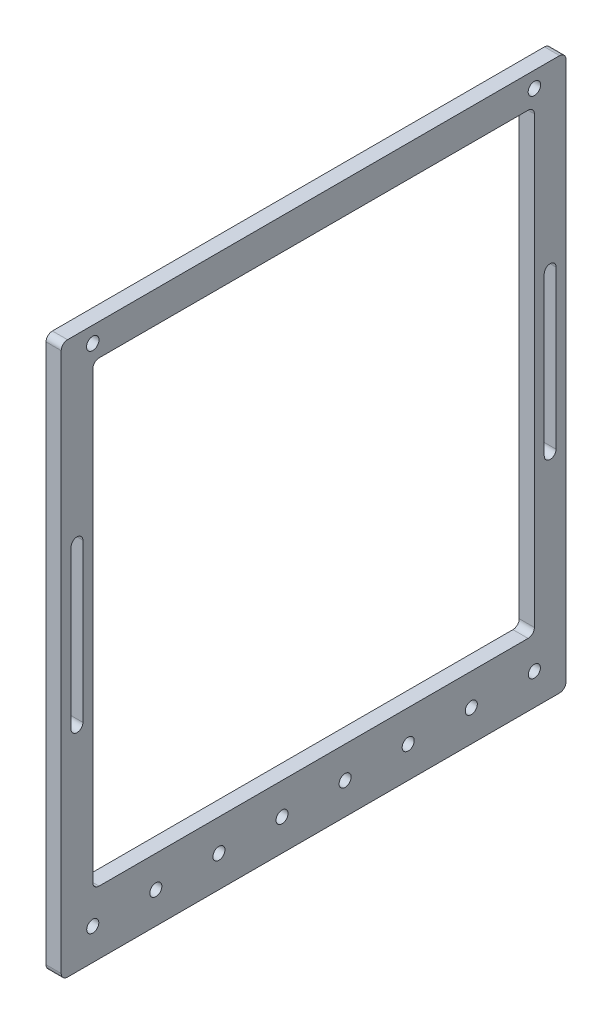
ISO-10303-21;
HEADER;
FILE_DESCRIPTION(('STEP AP214'),'2;1');
FILE_NAME('part.step','',(''),(''),'','','');
FILE_SCHEMA(('AUTOMOTIVE_DESIGN { 1 0 10303 214 1 1 1 1 }'));
ENDSEC;
DATA;
#1=APPLICATION_CONTEXT('core data for automotive mechanical design processes');
#2=APPLICATION_PROTOCOL_DEFINITION('international standard','automotive_design',2000,#1);
#3=PRODUCT_CONTEXT('',#1,'mechanical');
#4=PRODUCT('Part','Part','',(#3));
#5=PRODUCT_RELATED_PRODUCT_CATEGORY('part','',(#4));
#6=PRODUCT_DEFINITION_FORMATION('','',#4);
#7=PRODUCT_DEFINITION_CONTEXT('part definition',#1,'design');
#8=PRODUCT_DEFINITION('design','',#6,#7);
#9=PRODUCT_DEFINITION_SHAPE('','',#8);
#10=(LENGTH_UNIT() NAMED_UNIT(*) SI_UNIT(.MILLI.,.METRE.));
#11=(NAMED_UNIT(*) PLANE_ANGLE_UNIT() SI_UNIT($,.RADIAN.));
#12=(NAMED_UNIT(*) SI_UNIT($,.STERADIAN.) SOLID_ANGLE_UNIT());
#13=UNCERTAINTY_MEASURE_WITH_UNIT(LENGTH_MEASURE(1.E-05),#10,'distance_accuracy_value','');
#14=(GEOMETRIC_REPRESENTATION_CONTEXT(3) GLOBAL_UNCERTAINTY_ASSIGNED_CONTEXT((#13)) GLOBAL_UNIT_ASSIGNED_CONTEXT((#10,
#11,#12)) REPRESENTATION_CONTEXT('',''));
#15=CARTESIAN_POINT('',(0.,0.,0.));
#16=DIRECTION('',(0.,0.,1.));
#17=DIRECTION('',(1.,0.,0.));
#18=AXIS2_PLACEMENT_3D('',#15,#16,#17);
#19=CARTESIAN_POINT('',(6.096,0.,0.));
#20=DIRECTION('',(1.,0.,0.));
#21=DIRECTION('',(0.,0.,-1.));
#22=AXIS2_PLACEMENT_3D('',#19,#20,#21);
#23=PLANE('',#22);
#24=CARTESIAN_POINT('',(6.096,6.34999999999999,-177.8));
#25=DIRECTION('',(1.,0.,0.));
#26=DIRECTION('',(0.,0.,-1.));
#27=AXIS2_PLACEMENT_3D('',#24,#25,#26);
#28=CIRCLE('',#27,2.50500000000001);
#29=CARTESIAN_POINT('',(6.096,6.34999999999999,-180.305));
#30=VERTEX_POINT('',#29);
#31=EDGE_CURVE('E231',#30,#30,#28,.T.);
#32=ORIENTED_EDGE('',*,*,#31,.F.);
#33=EDGE_LOOP('',(#32));
#34=FACE_BOUND('',#33,.T.);
#35=CARTESIAN_POINT('',(6.096,6.34999999999998,0.));
#36=DIRECTION('',(1.,0.,0.));
#37=DIRECTION('',(0.,0.,-1.));
#38=AXIS2_PLACEMENT_3D('',#35,#36,#37);
#39=CIRCLE('',#38,2.50500000000001);
#40=CARTESIAN_POINT('',(6.096,6.34999999999998,-2.50500000000001));
#41=VERTEX_POINT('',#40);
#42=EDGE_CURVE('E964',#41,#41,#39,.T.);
#43=ORIENTED_EDGE('',*,*,#42,.F.);
#44=EDGE_LOOP('',(#43));
#45=FACE_BOUND('',#44,.T.);
#46=CARTESIAN_POINT('',(6.096,-60.325,6.34999999999999));
#47=DIRECTION('',(1.,0.,0.));
#48=DIRECTION('',(0.,0.,-1.));
#49=AXIS2_PLACEMENT_3D('',#46,#47,#48);
#50=CIRCLE('',#49,2.38125000000005);
#51=CARTESIAN_POINT('',(6.096,-60.325,3.96874999999996));
#52=VERTEX_POINT('',#51);
#53=CARTESIAN_POINT('',(6.096,-60.325,8.73125000000006));
#54=VERTEX_POINT('',#53);
#55=EDGE_CURVE('E55',#52,#54,#50,.T.);
#56=ORIENTED_EDGE('',*,*,#55,.F.);
#57=DIRECTION('',(0.,1.,0.));
#58=VECTOR('',#57,1.);
#59=CARTESIAN_POINT('',(6.096,-60.325,3.96874999999996));
#60=LINE('',#59,#58);
#61=CARTESIAN_POINT('',(6.096,-123.825,3.96874999999995));
#62=VERTEX_POINT('',#61);
#63=EDGE_CURVE('E224',#62,#52,#60,.T.);
#64=ORIENTED_EDGE('',*,*,#63,.F.);
#65=CARTESIAN_POINT('',(6.096,-123.825,6.34999999999999));
#66=DIRECTION('',(1.,0.,0.));
#67=DIRECTION('',(0.,0.,-1.));
#68=AXIS2_PLACEMENT_3D('',#65,#66,#67);
#69=CIRCLE('',#68,2.38125000000005);
#70=CARTESIAN_POINT('',(6.096,-123.825,8.73125000000003));
#71=VERTEX_POINT('',#70);
#72=EDGE_CURVE('E228',#71,#62,#69,.T.);
#73=ORIENTED_EDGE('',*,*,#72,.F.);
#74=DIRECTION('',(0.,-1.,0.));
#75=VECTOR('',#74,1.);
#76=CARTESIAN_POINT('',(6.096,-60.325,8.73125000000006));
#77=LINE('',#76,#75);
#78=EDGE_CURVE('E240',#54,#71,#77,.T.);
#79=ORIENTED_EDGE('',*,*,#78,.F.);
#80=EDGE_LOOP('',(#56,#64,#73,#79));
#81=FACE_BOUND('',#80,.T.);
#82=CARTESIAN_POINT('',(6.096,-60.325,-184.15));
#83=DIRECTION('',(1.,0.,0.));
#84=DIRECTION('',(0.,0.,1.));
#85=AXIS2_PLACEMENT_3D('',#82,#83,#84);
#86=CIRCLE('',#85,2.38125000000004);
#87=CARTESIAN_POINT('',(6.096,-60.325,-186.53125));
#88=VERTEX_POINT('',#87);
#89=CARTESIAN_POINT('',(6.096,-60.325,-181.76875));
#90=VERTEX_POINT('',#89);
#91=EDGE_CURVE('E63',#88,#90,#86,.T.);
#92=ORIENTED_EDGE('',*,*,#91,.F.);
#93=DIRECTION('',(0.,1.,0.));
#94=VECTOR('',#93,1.);
#95=CARTESIAN_POINT('',(6.096,-60.325,-186.53125));
#96=LINE('',#95,#94);
#97=CARTESIAN_POINT('',(6.096,-123.825,-186.53125));
#98=VERTEX_POINT('',#97);
#99=EDGE_CURVE('E261',#98,#88,#96,.T.);
#100=ORIENTED_EDGE('',*,*,#99,.F.);
#101=CARTESIAN_POINT('',(6.096,-123.825,-184.15));
#102=DIRECTION('',(1.,0.,0.));
#103=DIRECTION('',(0.,0.,1.));
#104=AXIS2_PLACEMENT_3D('',#101,#102,#103);
#105=CIRCLE('',#104,2.38125000000004);
#106=CARTESIAN_POINT('',(6.096,-123.825,-181.76875));
#107=VERTEX_POINT('',#106);
#108=EDGE_CURVE('E280',#107,#98,#105,.T.);
#109=ORIENTED_EDGE('',*,*,#108,.F.);
#110=DIRECTION('',(0.,-1.,0.));
#111=VECTOR('',#110,1.);
#112=CARTESIAN_POINT('',(6.096,-60.325,-181.76875));
#113=LINE('',#112,#111);
#114=EDGE_CURVE('E276',#90,#107,#113,.T.);
#115=ORIENTED_EDGE('',*,*,#114,.F.);
#116=EDGE_LOOP('',(#92,#100,#109,#115));
#117=FACE_BOUND('',#116,.T.);
#118=CARTESIAN_POINT('',(6.096,-196.85,-152.4));
#119=DIRECTION('',(1.,0.,0.));
#120=DIRECTION('',(0.,0.,-1.));
#121=AXIS2_PLACEMENT_3D('',#118,#119,#120);
#122=CIRCLE('',#121,2.42499999999998);
#123=CARTESIAN_POINT('',(6.096,-196.85,-154.825));
#124=VERTEX_POINT('',#123);
#125=EDGE_CURVE('E305',#124,#124,#122,.T.);
#126=ORIENTED_EDGE('',*,*,#125,.F.);
#127=EDGE_LOOP('',(#126));
#128=FACE_BOUND('',#127,.T.);
#129=CARTESIAN_POINT('',(6.096,-196.85,-101.6));
#130=DIRECTION('',(1.,0.,0.));
#131=DIRECTION('',(0.,0.,-1.));
#132=AXIS2_PLACEMENT_3D('',#129,#130,#131);
#133=CIRCLE('',#132,2.425);
#134=CARTESIAN_POINT('',(6.096,-196.85,-104.025));
#135=VERTEX_POINT('',#134);
#136=EDGE_CURVE('E321',#135,#135,#133,.T.);
#137=ORIENTED_EDGE('',*,*,#136,.F.);
#138=EDGE_LOOP('',(#137));
#139=FACE_BOUND('',#138,.T.);
#140=CARTESIAN_POINT('',(6.096,-196.85,-50.8));
#141=DIRECTION('',(1.,0.,0.));
#142=DIRECTION('',(0.,0.,-1.));
#143=AXIS2_PLACEMENT_3D('',#140,#141,#142);
#144=CIRCLE('',#143,2.425);
#145=CARTESIAN_POINT('',(6.096,-196.85,-53.225));
#146=VERTEX_POINT('',#145);
#147=EDGE_CURVE('E337',#146,#146,#144,.T.);
#148=ORIENTED_EDGE('',*,*,#147,.F.);
#149=EDGE_LOOP('',(#148));
#150=FACE_BOUND('',#149,.T.);
#151=CARTESIAN_POINT('',(6.096,-196.85,0.));
#152=DIRECTION('',(1.,0.,0.));
#153=DIRECTION('',(0.,0.,-1.));
#154=AXIS2_PLACEMENT_3D('',#151,#152,#153);
#155=CIRCLE('',#154,2.42499999999999);
#156=CARTESIAN_POINT('',(6.096,-196.85,-2.42500000000002));
#157=VERTEX_POINT('',#156);
#158=EDGE_CURVE('E353',#157,#157,#155,.T.);
#159=ORIENTED_EDGE('',*,*,#158,.F.);
#160=EDGE_LOOP('',(#159));
#161=FACE_BOUND('',#160,.T.);
#162=DIRECTION('',(0.,1.,0.));
#163=VECTOR('',#162,1.);
#164=CARTESIAN_POINT('',(6.096,12.7,-190.5));
#165=LINE('',#164,#163);
#166=CARTESIAN_POINT('',(6.096,-207.01,-190.5));
#167=VERTEX_POINT('',#166);
#168=CARTESIAN_POINT('',(6.096,10.16,-190.5));
#169=VERTEX_POINT('',#168);
#170=EDGE_CURVE('E402',#167,#169,#165,.T.);
#171=ORIENTED_EDGE('',*,*,#170,.T.);
#172=CARTESIAN_POINT('',(6.096,10.16,-187.96));
#173=DIRECTION('',(1.,0.,0.));
#174=DIRECTION('',(0.,0.,-1.));
#175=AXIS2_PLACEMENT_3D('',#172,#173,#174);
#176=CIRCLE('',#175,2.54);
#177=CARTESIAN_POINT('',(6.096,12.7,-187.96));
#178=VERTEX_POINT('',#177);
#179=EDGE_CURVE('E459',#169,#178,#176,.T.);
#180=ORIENTED_EDGE('',*,*,#179,.T.);
#181=DIRECTION('',(0.,0.,1.));
#182=VECTOR('',#181,1.);
#183=CARTESIAN_POINT('',(6.096,12.7,12.7));
#184=LINE('',#183,#182);
#185=CARTESIAN_POINT('',(6.096,12.7,10.16));
#186=VERTEX_POINT('',#185);
#187=EDGE_CURVE('E406',#178,#186,#184,.T.);
#188=ORIENTED_EDGE('',*,*,#187,.T.);
#189=CARTESIAN_POINT('',(6.096,10.16,10.16));
#190=DIRECTION('',(1.,0.,0.));
#191=DIRECTION('',(0.,0.,-1.));
#192=AXIS2_PLACEMENT_3D('',#189,#190,#191);
#193=CIRCLE('',#192,2.54);
#194=CARTESIAN_POINT('',(6.096,10.16,12.7));
#195=VERTEX_POINT('',#194);
#196=EDGE_CURVE('E456',#186,#195,#193,.T.);
#197=ORIENTED_EDGE('',*,*,#196,.T.);
#198=DIRECTION('',(0.,-1.,0.));
#199=VECTOR('',#198,1.);
#200=CARTESIAN_POINT('',(6.096,12.7,12.7));
#201=LINE('',#200,#199);
#202=CARTESIAN_POINT('',(6.096,-207.01,12.7));
#203=VERTEX_POINT('',#202);
#204=EDGE_CURVE('E393',#195,#203,#201,.T.);
#205=ORIENTED_EDGE('',*,*,#204,.T.);
#206=CARTESIAN_POINT('',(6.096,-207.01,10.16));
#207=DIRECTION('',(1.,0.,0.));
#208=DIRECTION('',(0.,0.,-1.));
#209=AXIS2_PLACEMENT_3D('',#206,#207,#208);
#210=CIRCLE('',#209,2.54);
#211=CARTESIAN_POINT('',(6.096,-209.55,10.16));
#212=VERTEX_POINT('',#211);
#213=EDGE_CURVE('E450',#203,#212,#210,.T.);
#214=ORIENTED_EDGE('',*,*,#213,.T.);
#215=DIRECTION('',(0.,0.,-1.));
#216=VECTOR('',#215,1.);
#217=CARTESIAN_POINT('',(6.096,-209.55,12.7));
#218=LINE('',#217,#216);
#219=CARTESIAN_POINT('',(6.096,-209.55,-187.96));
#220=VERTEX_POINT('',#219);
#221=EDGE_CURVE('E397',#212,#220,#218,.T.);
#222=ORIENTED_EDGE('',*,*,#221,.T.);
#223=CARTESIAN_POINT('',(6.096,-207.01,-187.96));
#224=DIRECTION('',(1.,0.,0.));
#225=DIRECTION('',(0.,0.,-1.));
#226=AXIS2_PLACEMENT_3D('',#223,#224,#225);
#227=CIRCLE('',#226,2.54);
#228=EDGE_CURVE('E453',#220,#167,#227,.T.);
#229=ORIENTED_EDGE('',*,*,#228,.T.);
#230=EDGE_LOOP('',(#171,#180,#188,#197,#205,#214,#222,#229));
#231=FACE_BOUND('',#230,.T.);
#232=DIRECTION('',(0.,0.,-1.));
#233=VECTOR('',#232,1.);
#234=CARTESIAN_POINT('',(6.096,-184.15,0.));
#235=LINE('',#234,#233);
#236=CARTESIAN_POINT('',(6.096,-184.15,-2.54000000000002));
#237=VERTEX_POINT('',#236);
#238=CARTESIAN_POINT('',(6.096,-184.15,-175.26));
#239=VERTEX_POINT('',#238);
#240=EDGE_CURVE('E365',#237,#239,#235,.T.);
#241=ORIENTED_EDGE('',*,*,#240,.F.);
#242=CARTESIAN_POINT('',(6.096,-181.61,-2.54000000000002));
#243=DIRECTION('',(1.,0.,0.));
#244=DIRECTION('',(0.,0.,-1.));
#245=AXIS2_PLACEMENT_3D('',#242,#243,#244);
#246=CIRCLE('',#245,2.54);
#247=CARTESIAN_POINT('',(6.096,-181.61,0.));
#248=VERTEX_POINT('',#247);
#249=EDGE_CURVE('E507',#237,#248,#246,.F.);
#250=ORIENTED_EDGE('',*,*,#249,.T.);
#251=DIRECTION('',(0.,-1.,0.));
#252=VECTOR('',#251,1.);
#253=CARTESIAN_POINT('',(6.096,0.,0.));
#254=LINE('',#253,#252);
#255=CARTESIAN_POINT('',(6.096,-2.54,0.));
#256=VERTEX_POINT('',#255);
#257=EDGE_CURVE('E361',#256,#248,#254,.T.);
#258=ORIENTED_EDGE('',*,*,#257,.F.);
#259=CARTESIAN_POINT('',(6.096,-2.54,-2.54));
#260=DIRECTION('',(1.,0.,0.));
#261=DIRECTION('',(0.,0.,-1.));
#262=AXIS2_PLACEMENT_3D('',#259,#260,#261);
#263=CIRCLE('',#262,2.54);
#264=CARTESIAN_POINT('',(6.096,0.,-2.54));
#265=VERTEX_POINT('',#264);
#266=EDGE_CURVE('E11',#256,#265,#263,.F.);
#267=ORIENTED_EDGE('',*,*,#266,.T.);
#268=DIRECTION('',(0.,0.,1.));
#269=VECTOR('',#268,1.);
#270=CARTESIAN_POINT('',(6.096,0.,0.));
#271=LINE('',#270,#269);
#272=CARTESIAN_POINT('',(6.096,0.,-175.26));
#273=VERTEX_POINT('',#272);
#274=EDGE_CURVE('E374',#273,#265,#271,.T.);
#275=ORIENTED_EDGE('',*,*,#274,.F.);
#276=CARTESIAN_POINT('',(6.096,-2.54,-175.26));
#277=DIRECTION('',(1.,0.,0.));
#278=DIRECTION('',(0.,0.,-1.));
#279=AXIS2_PLACEMENT_3D('',#276,#277,#278);
#280=CIRCLE('',#279,2.54);
#281=CARTESIAN_POINT('',(6.096,-2.54,-177.8));
#282=VERTEX_POINT('',#281);
#283=EDGE_CURVE('E519',#273,#282,#280,.F.);
#284=ORIENTED_EDGE('',*,*,#283,.T.);
#285=DIRECTION('',(0.,1.,0.));
#286=VECTOR('',#285,1.);
#287=CARTESIAN_POINT('',(6.096,0.,-177.8));
#288=LINE('',#287,#286);
#289=CARTESIAN_POINT('',(6.096,-181.61,-177.8));
#290=VERTEX_POINT('',#289);
#291=EDGE_CURVE('E370',#290,#282,#288,.T.);
#292=ORIENTED_EDGE('',*,*,#291,.F.);
#293=CARTESIAN_POINT('',(6.096,-181.61,-175.26));
#294=DIRECTION('',(1.,0.,0.));
#295=DIRECTION('',(0.,0.,-1.));
#296=AXIS2_PLACEMENT_3D('',#293,#294,#295);
#297=CIRCLE('',#296,2.54);
#298=EDGE_CURVE('E513',#290,#239,#297,.F.);
#299=ORIENTED_EDGE('',*,*,#298,.T.);
#300=EDGE_LOOP('',(#241,#250,#258,#267,#275,#284,#292,#299));
#301=FACE_BOUND('',#300,.T.);
#302=CARTESIAN_POINT('',(6.096,-196.85,-25.4));
#303=DIRECTION('',(1.,0.,0.));
#304=DIRECTION('',(0.,0.,-1.));
#305=AXIS2_PLACEMENT_3D('',#302,#303,#304);
#306=CIRCLE('',#305,2.42499999999999);
#307=CARTESIAN_POINT('',(6.096,-196.85,-27.825));
#308=VERTEX_POINT('',#307);
#309=EDGE_CURVE('E345',#308,#308,#306,.T.);
#310=ORIENTED_EDGE('',*,*,#309,.F.);
#311=EDGE_LOOP('',(#310));
#312=FACE_BOUND('',#311,.T.);
#313=CARTESIAN_POINT('',(6.096,-196.85,-76.2));
#314=DIRECTION('',(1.,0.,0.));
#315=DIRECTION('',(0.,0.,-1.));
#316=AXIS2_PLACEMENT_3D('',#313,#314,#315);
#317=CIRCLE('',#316,2.425);
#318=CARTESIAN_POINT('',(6.096,-196.85,-78.625));
#319=VERTEX_POINT('',#318);
#320=EDGE_CURVE('E329',#319,#319,#317,.T.);
#321=ORIENTED_EDGE('',*,*,#320,.F.);
#322=EDGE_LOOP('',(#321));
#323=FACE_BOUND('',#322,.T.);
#324=CARTESIAN_POINT('',(6.096,-196.85,-127.));
#325=DIRECTION('',(1.,0.,0.));
#326=DIRECTION('',(0.,0.,-1.));
#327=AXIS2_PLACEMENT_3D('',#324,#325,#326);
#328=CIRCLE('',#327,2.42500000000001);
#329=CARTESIAN_POINT('',(6.096,-196.85,-129.425));
#330=VERTEX_POINT('',#329);
#331=EDGE_CURVE('E313',#330,#330,#328,.T.);
#332=ORIENTED_EDGE('',*,*,#331,.F.);
#333=EDGE_LOOP('',(#332));
#334=FACE_BOUND('',#333,.T.);
#335=CARTESIAN_POINT('',(6.096,-196.85,-177.8));
#336=DIRECTION('',(1.,0.,0.));
#337=DIRECTION('',(0.,0.,-1.));
#338=AXIS2_PLACEMENT_3D('',#335,#336,#337);
#339=CIRCLE('',#338,2.42499999999998);
#340=CARTESIAN_POINT('',(6.096,-196.85,-180.225));
#341=VERTEX_POINT('',#340);
#342=EDGE_CURVE('E297',#341,#341,#339,.T.);
#343=ORIENTED_EDGE('',*,*,#342,.F.);
#344=EDGE_LOOP('',(#343));
#345=FACE_BOUND('',#344,.T.);
#346=ADVANCED_FACE('F39',(#34,#45,#81,#117,#128,#139,#150,#161,#231,#301,#312,#323,#334,#345),
#23,.T.);
#347=CARTESIAN_POINT('',(0.,0.,0.));
#348=DIRECTION('',(1.,0.,0.));
#349=DIRECTION('',(0.,0.,-1.));
#350=AXIS2_PLACEMENT_3D('',#347,#348,#349);
#351=PLANE('',#350);
#352=CARTESIAN_POINT('',(0.,6.34999999999999,-177.8));
#353=DIRECTION('',(1.,0.,0.));
#354=DIRECTION('',(0.,0.,-1.));
#355=AXIS2_PLACEMENT_3D('',#352,#353,#354);
#356=CIRCLE('',#355,2.50500000000001);
#357=CARTESIAN_POINT('',(0.,6.34999999999999,-180.305));
#358=VERTEX_POINT('',#357);
#359=EDGE_CURVE('E962',#358,#358,#356,.T.);
#360=ORIENTED_EDGE('',*,*,#359,.T.);
#361=EDGE_LOOP('',(#360));
#362=FACE_BOUND('',#361,.T.);
#363=CARTESIAN_POINT('',(0.,6.34999999999998,0.));
#364=DIRECTION('',(1.,0.,0.));
#365=DIRECTION('',(0.,0.,1.));
#366=AXIS2_PLACEMENT_3D('',#363,#364,#365);
#367=CIRCLE('',#366,2.50500000000001);
#368=CARTESIAN_POINT('',(0.,6.34999999999998,2.50500000000001));
#369=VERTEX_POINT('',#368);
#370=EDGE_CURVE('E965',#369,#369,#367,.T.);
#371=ORIENTED_EDGE('',*,*,#370,.T.);
#372=EDGE_LOOP('',(#371));
#373=FACE_BOUND('',#372,.T.);
#374=DIRECTION('',(0.,1.,0.));
#375=VECTOR('',#374,1.);
#376=CARTESIAN_POINT('',(0.,-60.325,3.96874999999996));
#377=LINE('',#376,#375);
#378=CARTESIAN_POINT('',(0.,-123.825,3.96874999999995));
#379=VERTEX_POINT('',#378);
#380=CARTESIAN_POINT('',(0.,-60.325,3.96874999999996));
#381=VERTEX_POINT('',#380);
#382=EDGE_CURVE('E209',#379,#381,#377,.T.);
#383=ORIENTED_EDGE('',*,*,#382,.T.);
#384=CARTESIAN_POINT('',(0.,-60.325,6.34999999999999));
#385=DIRECTION('',(1.,0.,0.));
#386=DIRECTION('',(0.,0.,-1.));
#387=AXIS2_PLACEMENT_3D('',#384,#385,#386);
#388=CIRCLE('',#387,2.38125000000005);
#389=CARTESIAN_POINT('',(0.,-60.325,8.73125000000006));
#390=VERTEX_POINT('',#389);
#391=EDGE_CURVE('E202',#381,#390,#388,.T.);
#392=ORIENTED_EDGE('',*,*,#391,.T.);
#393=DIRECTION('',(0.,-1.,0.));
#394=VECTOR('',#393,1.);
#395=CARTESIAN_POINT('',(0.,-60.325,8.73125000000006));
#396=LINE('',#395,#394);
#397=CARTESIAN_POINT('',(0.,-123.825,8.73125000000005));
#398=VERTEX_POINT('',#397);
#399=EDGE_CURVE('E213',#390,#398,#396,.T.);
#400=ORIENTED_EDGE('',*,*,#399,.T.);
#401=CARTESIAN_POINT('',(0.,-123.825,6.34999999999999));
#402=DIRECTION('',(1.,0.,0.));
#403=DIRECTION('',(0.,0.,-1.));
#404=AXIS2_PLACEMENT_3D('',#401,#402,#403);
#405=CIRCLE('',#404,2.38125000000005);
#406=EDGE_CURVE('E218',#398,#379,#405,.T.);
#407=ORIENTED_EDGE('',*,*,#406,.T.);
#408=EDGE_LOOP('',(#383,#392,#400,#407));
#409=FACE_BOUND('',#408,.T.);
#410=DIRECTION('',(0.,1.,0.));
#411=VECTOR('',#410,1.);
#412=CARTESIAN_POINT('',(0.,-60.325,-186.53125));
#413=LINE('',#412,#411);
#414=CARTESIAN_POINT('',(0.,-123.825,-186.53125));
#415=VERTEX_POINT('',#414);
#416=CARTESIAN_POINT('',(0.,-60.325,-186.53125));
#417=VERTEX_POINT('',#416);
#418=EDGE_CURVE('E269',#415,#417,#413,.T.);
#419=ORIENTED_EDGE('',*,*,#418,.T.);
#420=CARTESIAN_POINT('',(0.,-60.325,-184.15));
#421=DIRECTION('',(1.,0.,0.));
#422=DIRECTION('',(0.,0.,1.));
#423=AXIS2_PLACEMENT_3D('',#420,#421,#422);
#424=CIRCLE('',#423,2.38125000000004);
#425=CARTESIAN_POINT('',(0.,-60.325,-181.76875));
#426=VERTEX_POINT('',#425);
#427=EDGE_CURVE('E256',#417,#426,#424,.T.);
#428=ORIENTED_EDGE('',*,*,#427,.T.);
#429=DIRECTION('',(0.,-1.,0.));
#430=VECTOR('',#429,1.);
#431=CARTESIAN_POINT('',(0.,-60.325,-181.76875));
#432=LINE('',#431,#430);
#433=CARTESIAN_POINT('',(0.,-123.825,-181.76875));
#434=VERTEX_POINT('',#433);
#435=EDGE_CURVE('E260',#426,#434,#432,.T.);
#436=ORIENTED_EDGE('',*,*,#435,.T.);
#437=CARTESIAN_POINT('',(0.,-123.825,-184.15));
#438=DIRECTION('',(1.,0.,0.));
#439=DIRECTION('',(0.,0.,1.));
#440=AXIS2_PLACEMENT_3D('',#437,#438,#439);
#441=CIRCLE('',#440,2.38125000000004);
#442=EDGE_CURVE('E265',#434,#415,#441,.T.);
#443=ORIENTED_EDGE('',*,*,#442,.T.);
#444=EDGE_LOOP('',(#419,#428,#436,#443));
#445=FACE_BOUND('',#444,.T.);
#446=DIRECTION('',(0.,0.,1.));
#447=VECTOR('',#446,1.);
#448=CARTESIAN_POINT('',(0.,12.7,12.7));
#449=LINE('',#448,#447);
#450=CARTESIAN_POINT('',(0.,12.7,-187.96));
#451=VERTEX_POINT('',#450);
#452=CARTESIAN_POINT('',(0.,12.7,10.16));
#453=VERTEX_POINT('',#452);
#454=EDGE_CURVE('E398',#451,#453,#449,.T.);
#455=ORIENTED_EDGE('',*,*,#454,.F.);
#456=CARTESIAN_POINT('',(0.,10.16,-187.96));
#457=DIRECTION('',(1.,0.,0.));
#458=DIRECTION('',(0.,0.,-1.));
#459=AXIS2_PLACEMENT_3D('',#456,#457,#458);
#460=CIRCLE('',#459,2.54);
#461=CARTESIAN_POINT('',(0.,10.16,-190.5));
#462=VERTEX_POINT('',#461);
#463=EDGE_CURVE('E440',#451,#462,#460,.F.);
#464=ORIENTED_EDGE('',*,*,#463,.T.);
#465=DIRECTION('',(0.,1.,0.));
#466=VECTOR('',#465,1.);
#467=CARTESIAN_POINT('',(0.,12.7,-190.5));
#468=LINE('',#467,#466);
#469=CARTESIAN_POINT('',(0.,-207.01,-190.5));
#470=VERTEX_POINT('',#469);
#471=EDGE_CURVE('E418',#470,#462,#468,.T.);
#472=ORIENTED_EDGE('',*,*,#471,.F.);
#473=CARTESIAN_POINT('',(0.,-207.01,-187.96));
#474=DIRECTION('',(1.,0.,0.));
#475=DIRECTION('',(0.,0.,-1.));
#476=AXIS2_PLACEMENT_3D('',#473,#474,#475);
#477=CIRCLE('',#476,2.54);
#478=CARTESIAN_POINT('',(0.,-209.55,-187.96));
#479=VERTEX_POINT('',#478);
#480=EDGE_CURVE('E434',#470,#479,#477,.F.);
#481=ORIENTED_EDGE('',*,*,#480,.T.);
#482=DIRECTION('',(0.,0.,-1.));
#483=VECTOR('',#482,1.);
#484=CARTESIAN_POINT('',(0.,-209.55,12.7));
#485=LINE('',#484,#483);
#486=CARTESIAN_POINT('',(0.,-209.55,10.16));
#487=VERTEX_POINT('',#486);
#488=EDGE_CURVE('E414',#487,#479,#485,.T.);
#489=ORIENTED_EDGE('',*,*,#488,.F.);
#490=CARTESIAN_POINT('',(0.,-207.01,10.16));
#491=DIRECTION('',(1.,0.,0.));
#492=DIRECTION('',(0.,0.,-1.));
#493=AXIS2_PLACEMENT_3D('',#490,#491,#492);
#494=CIRCLE('',#493,2.54);
#495=CARTESIAN_POINT('',(0.,-207.01,12.7));
#496=VERTEX_POINT('',#495);
#497=EDGE_CURVE('E431',#487,#496,#494,.F.);
#498=ORIENTED_EDGE('',*,*,#497,.T.);
#499=DIRECTION('',(0.,-1.,0.));
#500=VECTOR('',#499,1.);
#501=CARTESIAN_POINT('',(0.,12.7,12.7));
#502=LINE('',#501,#500);
#503=CARTESIAN_POINT('',(0.,10.16,12.7));
#504=VERTEX_POINT('',#503);
#505=EDGE_CURVE('E378',#504,#496,#502,.T.);
#506=ORIENTED_EDGE('',*,*,#505,.F.);
#507=CARTESIAN_POINT('',(0.,10.16,10.16));
#508=DIRECTION('',(1.,0.,0.));
#509=DIRECTION('',(0.,0.,-1.));
#510=AXIS2_PLACEMENT_3D('',#507,#508,#509);
#511=CIRCLE('',#510,2.54);
#512=EDGE_CURVE('E437',#504,#453,#511,.F.);
#513=ORIENTED_EDGE('',*,*,#512,.T.);
#514=EDGE_LOOP('',(#455,#464,#472,#481,#489,#498,#506,#513));
#515=FACE_BOUND('',#514,.T.);
#516=DIRECTION('',(0.,0.,1.));
#517=VECTOR('',#516,1.);
#518=CARTESIAN_POINT('',(0.,0.,0.));
#519=LINE('',#518,#517);
#520=CARTESIAN_POINT('',(0.,0.,-175.26));
#521=VERTEX_POINT('',#520);
#522=CARTESIAN_POINT('',(0.,0.,-2.54));
#523=VERTEX_POINT('',#522);
#524=EDGE_CURVE('E366',#521,#523,#519,.T.);
#525=ORIENTED_EDGE('',*,*,#524,.T.);
#526=CARTESIAN_POINT('',(0.,-2.54,-2.54));
#527=DIRECTION('',(1.,0.,0.));
#528=DIRECTION('',(0.,0.,-1.));
#529=AXIS2_PLACEMENT_3D('',#526,#527,#528);
#530=CIRCLE('',#529,2.54);
#531=CARTESIAN_POINT('',(0.,-2.54,0.));
#532=VERTEX_POINT('',#531);
#533=EDGE_CURVE('E48',#523,#532,#530,.T.);
#534=ORIENTED_EDGE('',*,*,#533,.T.);
#535=DIRECTION('',(0.,-1.,0.));
#536=VECTOR('',#535,1.);
#537=CARTESIAN_POINT('',(0.,0.,0.));
#538=LINE('',#537,#536);
#539=CARTESIAN_POINT('',(0.,-181.61,0.));
#540=VERTEX_POINT('',#539);
#541=EDGE_CURVE('E357',#532,#540,#538,.T.);
#542=ORIENTED_EDGE('',*,*,#541,.T.);
#543=CARTESIAN_POINT('',(0.,-181.61,-2.54000000000002));
#544=DIRECTION('',(1.,0.,0.));
#545=DIRECTION('',(0.,0.,-1.));
#546=AXIS2_PLACEMENT_3D('',#543,#544,#545);
#547=CIRCLE('',#546,2.54);
#548=CARTESIAN_POINT('',(0.,-184.15,-2.54000000000002));
#549=VERTEX_POINT('',#548);
#550=EDGE_CURVE('E504',#540,#549,#547,.T.);
#551=ORIENTED_EDGE('',*,*,#550,.T.);
#552=DIRECTION('',(0.,0.,-1.));
#553=VECTOR('',#552,1.);
#554=CARTESIAN_POINT('',(0.,-184.15,0.));
#555=LINE('',#554,#553);
#556=CARTESIAN_POINT('',(0.,-184.15,-175.26));
#557=VERTEX_POINT('',#556);
#558=EDGE_CURVE('E382',#549,#557,#555,.T.);
#559=ORIENTED_EDGE('',*,*,#558,.T.);
#560=CARTESIAN_POINT('',(0.,-181.61,-175.26));
#561=DIRECTION('',(1.,0.,0.));
#562=DIRECTION('',(0.,0.,-1.));
#563=AXIS2_PLACEMENT_3D('',#560,#561,#562);
#564=CIRCLE('',#563,2.54);
#565=CARTESIAN_POINT('',(0.,-181.61,-177.8));
#566=VERTEX_POINT('',#565);
#567=EDGE_CURVE('E510',#557,#566,#564,.T.);
#568=ORIENTED_EDGE('',*,*,#567,.T.);
#569=DIRECTION('',(0.,1.,0.));
#570=VECTOR('',#569,1.);
#571=CARTESIAN_POINT('',(0.,0.,-177.8));
#572=LINE('',#571,#570);
#573=CARTESIAN_POINT('',(0.,-2.54,-177.8));
#574=VERTEX_POINT('',#573);
#575=EDGE_CURVE('E386',#566,#574,#572,.T.);
#576=ORIENTED_EDGE('',*,*,#575,.T.);
#577=CARTESIAN_POINT('',(0.,-2.54,-175.26));
#578=DIRECTION('',(1.,0.,0.));
#579=DIRECTION('',(0.,0.,-1.));
#580=AXIS2_PLACEMENT_3D('',#577,#578,#579);
#581=CIRCLE('',#580,2.54);
#582=EDGE_CURVE('E516',#574,#521,#581,.T.);
#583=ORIENTED_EDGE('',*,*,#582,.T.);
#584=EDGE_LOOP('',(#525,#534,#542,#551,#559,#568,#576,#583));
#585=FACE_BOUND('',#584,.T.);
#586=CARTESIAN_POINT('',(0.,-196.85,0.));
#587=DIRECTION('',(1.,0.,0.));
#588=DIRECTION('',(0.,0.,-1.));
#589=AXIS2_PLACEMENT_3D('',#586,#587,#588);
#590=CIRCLE('',#589,2.42499999999999);
#591=CARTESIAN_POINT('',(0.,-196.85,-2.42500000000002));
#592=VERTEX_POINT('',#591);
#593=EDGE_CURVE('E349',#592,#592,#590,.T.);
#594=ORIENTED_EDGE('',*,*,#593,.T.);
#595=EDGE_LOOP('',(#594));
#596=FACE_BOUND('',#595,.T.);
#597=CARTESIAN_POINT('',(0.,-196.85,-25.4));
#598=DIRECTION('',(1.,0.,0.));
#599=DIRECTION('',(0.,0.,-1.));
#600=AXIS2_PLACEMENT_3D('',#597,#598,#599);
#601=CIRCLE('',#600,2.42499999999999);
#602=CARTESIAN_POINT('',(0.,-196.85,-27.825));
#603=VERTEX_POINT('',#602);
#604=EDGE_CURVE('E341',#603,#603,#601,.T.);
#605=ORIENTED_EDGE('',*,*,#604,.T.);
#606=EDGE_LOOP('',(#605));
#607=FACE_BOUND('',#606,.T.);
#608=CARTESIAN_POINT('',(0.,-196.85,-50.8));
#609=DIRECTION('',(1.,0.,0.));
#610=DIRECTION('',(0.,0.,-1.));
#611=AXIS2_PLACEMENT_3D('',#608,#609,#610);
#612=CIRCLE('',#611,2.425);
#613=CARTESIAN_POINT('',(0.,-196.85,-53.225));
#614=VERTEX_POINT('',#613);
#615=EDGE_CURVE('E333',#614,#614,#612,.T.);
#616=ORIENTED_EDGE('',*,*,#615,.T.);
#617=EDGE_LOOP('',(#616));
#618=FACE_BOUND('',#617,.T.);
#619=CARTESIAN_POINT('',(0.,-196.85,-76.2));
#620=DIRECTION('',(1.,0.,0.));
#621=DIRECTION('',(0.,0.,-1.));
#622=AXIS2_PLACEMENT_3D('',#619,#620,#621);
#623=CIRCLE('',#622,2.425);
#624=CARTESIAN_POINT('',(0.,-196.85,-78.625));
#625=VERTEX_POINT('',#624);
#626=EDGE_CURVE('E325',#625,#625,#623,.T.);
#627=ORIENTED_EDGE('',*,*,#626,.T.);
#628=EDGE_LOOP('',(#627));
#629=FACE_BOUND('',#628,.T.);
#630=CARTESIAN_POINT('',(0.,-196.85,-101.6));
#631=DIRECTION('',(1.,0.,0.));
#632=DIRECTION('',(0.,0.,-1.));
#633=AXIS2_PLACEMENT_3D('',#630,#631,#632);
#634=CIRCLE('',#633,2.425);
#635=CARTESIAN_POINT('',(0.,-196.85,-104.025));
#636=VERTEX_POINT('',#635);
#637=EDGE_CURVE('E317',#636,#636,#634,.T.);
#638=ORIENTED_EDGE('',*,*,#637,.T.);
#639=EDGE_LOOP('',(#638));
#640=FACE_BOUND('',#639,.T.);
#641=CARTESIAN_POINT('',(0.,-196.85,-127.));
#642=DIRECTION('',(1.,0.,0.));
#643=DIRECTION('',(0.,0.,-1.));
#644=AXIS2_PLACEMENT_3D('',#641,#642,#643);
#645=CIRCLE('',#644,2.42500000000001);
#646=CARTESIAN_POINT('',(0.,-196.85,-129.425));
#647=VERTEX_POINT('',#646);
#648=EDGE_CURVE('E309',#647,#647,#645,.T.);
#649=ORIENTED_EDGE('',*,*,#648,.T.);
#650=EDGE_LOOP('',(#649));
#651=FACE_BOUND('',#650,.T.);
#652=CARTESIAN_POINT('',(0.,-196.85,-152.4));
#653=DIRECTION('',(1.,0.,0.));
#654=DIRECTION('',(0.,0.,-1.));
#655=AXIS2_PLACEMENT_3D('',#652,#653,#654);
#656=CIRCLE('',#655,2.42499999999998);
#657=CARTESIAN_POINT('',(0.,-196.85,-154.825));
#658=VERTEX_POINT('',#657);
#659=EDGE_CURVE('E301',#658,#658,#656,.T.);
#660=ORIENTED_EDGE('',*,*,#659,.T.);
#661=EDGE_LOOP('',(#660));
#662=FACE_BOUND('',#661,.T.);
#663=CARTESIAN_POINT('',(0.,-196.85,-177.8));
#664=DIRECTION('',(1.,0.,0.));
#665=DIRECTION('',(0.,0.,-1.));
#666=AXIS2_PLACEMENT_3D('',#663,#664,#665);
#667=CIRCLE('',#666,2.42499999999998);
#668=CARTESIAN_POINT('',(0.,-196.85,-180.225));
#669=VERTEX_POINT('',#668);
#670=EDGE_CURVE('E250',#669,#669,#667,.T.);
#671=ORIENTED_EDGE('',*,*,#670,.T.);
#672=EDGE_LOOP('',(#671));
#673=FACE_BOUND('',#672,.T.);
#674=ADVANCED_FACE('F220',(#362,#373,#409,#445,#515,#585,#596,#607,#618,#629,#640,#651,#662,
#673),#351,.F.);
#675=CARTESIAN_POINT('',(6.096,12.7,12.7));
#676=DIRECTION('',(0.,0.,-1.));
#677=DIRECTION('',(0.,1.,0.));
#678=AXIS2_PLACEMENT_3D('',#675,#676,#677);
#679=PLANE('',#678);
#680=ORIENTED_EDGE('',*,*,#204,.F.);
#681=DIRECTION('',(-1.,0.,0.));
#682=VECTOR('',#681,1.);
#683=CARTESIAN_POINT('',(6.096,10.16,12.7));
#684=LINE('',#683,#682);
#685=EDGE_CURVE('E465',#195,#504,#684,.T.);
#686=ORIENTED_EDGE('',*,*,#685,.T.);
#687=ORIENTED_EDGE('',*,*,#505,.T.);
#688=DIRECTION('',(-1.,0.,0.));
#689=VECTOR('',#688,1.);
#690=CARTESIAN_POINT('',(6.096,-207.01,12.7));
#691=LINE('',#690,#689);
#692=EDGE_CURVE('E462',#496,#203,#691,.F.);
#693=ORIENTED_EDGE('',*,*,#692,.T.);
#694=EDGE_LOOP('',(#680,#686,#687,#693));
#695=FACE_BOUND('',#694,.T.);
#696=ADVANCED_FACE('F578',(#695),#679,.F.);
#697=CARTESIAN_POINT('',(6.096,-209.55,12.7));
#698=DIRECTION('',(0.,1.,0.));
#699=DIRECTION('',(0.,0.,1.));
#700=AXIS2_PLACEMENT_3D('',#697,#698,#699);
#701=PLANE('',#700);
#702=ORIENTED_EDGE('',*,*,#488,.T.);
#703=DIRECTION('',(-1.,0.,0.));
#704=VECTOR('',#703,1.);
#705=CARTESIAN_POINT('',(6.096,-209.55,-187.96));
#706=LINE('',#705,#704);
#707=EDGE_CURVE('E473',#479,#220,#706,.F.);
#708=ORIENTED_EDGE('',*,*,#707,.T.);
#709=ORIENTED_EDGE('',*,*,#221,.F.);
#710=DIRECTION('',(-1.,0.,0.));
#711=VECTOR('',#710,1.);
#712=CARTESIAN_POINT('',(6.096,-209.55,10.16));
#713=LINE('',#712,#711);
#714=EDGE_CURVE('E469',#212,#487,#713,.T.);
#715=ORIENTED_EDGE('',*,*,#714,.T.);
#716=EDGE_LOOP('',(#702,#708,#709,#715));
#717=FACE_BOUND('',#716,.T.);
#718=ADVANCED_FACE('F593',(#717),#701,.F.);
#719=CARTESIAN_POINT('',(6.096,12.7,-190.5));
#720=DIRECTION('',(0.,0.,1.));
#721=DIRECTION('',(0.,-1.,0.));
#722=AXIS2_PLACEMENT_3D('',#719,#720,#721);
#723=PLANE('',#722);
#724=ORIENTED_EDGE('',*,*,#471,.T.);
#725=DIRECTION('',(-1.,0.,0.));
#726=VECTOR('',#725,1.);
#727=CARTESIAN_POINT('',(6.096,10.16,-190.5));
#728=LINE('',#727,#726);
#729=EDGE_CURVE('E447',#462,#169,#728,.F.);
#730=ORIENTED_EDGE('',*,*,#729,.T.);
#731=ORIENTED_EDGE('',*,*,#170,.F.);
#732=DIRECTION('',(-1.,0.,0.));
#733=VECTOR('',#732,1.);
#734=CARTESIAN_POINT('',(6.096,-207.01,-190.5));
#735=LINE('',#734,#733);
#736=EDGE_CURVE('E443',#167,#470,#735,.T.);
#737=ORIENTED_EDGE('',*,*,#736,.T.);
#738=EDGE_LOOP('',(#724,#730,#731,#737));
#739=FACE_BOUND('',#738,.T.);
#740=ADVANCED_FACE('F589',(#739),#723,.F.);
#741=CARTESIAN_POINT('',(6.096,12.7,12.7));
#742=DIRECTION('',(0.,-1.,0.));
#743=DIRECTION('',(0.,0.,-1.));
#744=AXIS2_PLACEMENT_3D('',#741,#742,#743);
#745=PLANE('',#744);
#746=ORIENTED_EDGE('',*,*,#187,.F.);
#747=DIRECTION('',(-1.,0.,0.));
#748=VECTOR('',#747,1.);
#749=CARTESIAN_POINT('',(6.096,12.7,-187.96));
#750=LINE('',#749,#748);
#751=EDGE_CURVE('E427',#178,#451,#750,.T.);
#752=ORIENTED_EDGE('',*,*,#751,.T.);
#753=ORIENTED_EDGE('',*,*,#454,.T.);
#754=DIRECTION('',(-1.,0.,0.));
#755=VECTOR('',#754,1.);
#756=CARTESIAN_POINT('',(6.096,12.7,10.16));
#757=LINE('',#756,#755);
#758=EDGE_CURVE('E410',#453,#186,#757,.F.);
#759=ORIENTED_EDGE('',*,*,#758,.T.);
#760=EDGE_LOOP('',(#746,#752,#753,#759));
#761=FACE_BOUND('',#760,.T.);
#762=ADVANCED_FACE('F586',(#761),#745,.F.);
#763=CARTESIAN_POINT('',(6.096,0.,0.));
#764=DIRECTION('',(0.,0.,-1.));
#765=DIRECTION('',(0.,1.,0.));
#766=AXIS2_PLACEMENT_3D('',#763,#764,#765);
#767=PLANE('',#766);
#768=ORIENTED_EDGE('',*,*,#257,.T.);
#769=DIRECTION('',(-1.,0.,0.));
#770=VECTOR('',#769,1.);
#771=CARTESIAN_POINT('',(0.,-181.61,0.));
#772=LINE('',#771,#770);
#773=EDGE_CURVE('E479',#248,#540,#772,.T.);
#774=ORIENTED_EDGE('',*,*,#773,.T.);
#775=ORIENTED_EDGE('',*,*,#541,.F.);
#776=DIRECTION('',(-1.,0.,0.));
#777=VECTOR('',#776,1.);
#778=CARTESIAN_POINT('',(6.096,-2.54,0.));
#779=LINE('',#778,#777);
#780=EDGE_CURVE('E476',#532,#256,#779,.F.);
#781=ORIENTED_EDGE('',*,*,#780,.T.);
#782=EDGE_LOOP('',(#768,#774,#775,#781));
#783=FACE_BOUND('',#782,.T.);
#784=ADVANCED_FACE('F530',(#783),#767,.T.);
#785=CARTESIAN_POINT('',(6.096,-184.15,0.));
#786=DIRECTION('',(0.,1.,0.));
#787=DIRECTION('',(0.,0.,1.));
#788=AXIS2_PLACEMENT_3D('',#785,#786,#787);
#789=PLANE('',#788);
#790=ORIENTED_EDGE('',*,*,#558,.F.);
#791=DIRECTION('',(-1.,0.,0.));
#792=VECTOR('',#791,1.);
#793=CARTESIAN_POINT('',(6.096,-184.15,-2.54000000000002));
#794=LINE('',#793,#792);
#795=EDGE_CURVE('E487',#549,#237,#794,.F.);
#796=ORIENTED_EDGE('',*,*,#795,.T.);
#797=ORIENTED_EDGE('',*,*,#240,.T.);
#798=DIRECTION('',(-1.,0.,0.));
#799=VECTOR('',#798,1.);
#800=CARTESIAN_POINT('',(0.,-184.15,-175.26));
#801=LINE('',#800,#799);
#802=EDGE_CURVE('E483',#239,#557,#801,.T.);
#803=ORIENTED_EDGE('',*,*,#802,.T.);
#804=EDGE_LOOP('',(#790,#796,#797,#803));
#805=FACE_BOUND('',#804,.T.);
#806=ADVANCED_FACE('F557',(#805),#789,.T.);
#807=CARTESIAN_POINT('',(6.096,0.,-177.8));
#808=DIRECTION('',(0.,0.,1.));
#809=DIRECTION('',(0.,-1.,0.));
#810=AXIS2_PLACEMENT_3D('',#807,#808,#809);
#811=PLANE('',#810);
#812=ORIENTED_EDGE('',*,*,#575,.F.);
#813=DIRECTION('',(-1.,0.,0.));
#814=VECTOR('',#813,1.);
#815=CARTESIAN_POINT('',(6.096,-181.61,-177.8));
#816=LINE('',#815,#814);
#817=EDGE_CURVE('E494',#566,#290,#816,.F.);
#818=ORIENTED_EDGE('',*,*,#817,.T.);
#819=ORIENTED_EDGE('',*,*,#291,.T.);
#820=DIRECTION('',(-1.,0.,0.));
#821=VECTOR('',#820,1.);
#822=CARTESIAN_POINT('',(0.,-2.54,-177.8));
#823=LINE('',#822,#821);
#824=EDGE_CURVE('E490',#282,#574,#823,.T.);
#825=ORIENTED_EDGE('',*,*,#824,.T.);
#826=EDGE_LOOP('',(#812,#818,#819,#825));
#827=FACE_BOUND('',#826,.T.);
#828=ADVANCED_FACE('F549',(#827),#811,.T.);
#829=CARTESIAN_POINT('',(6.096,0.,0.));
#830=DIRECTION('',(0.,-1.,0.));
#831=DIRECTION('',(0.,0.,-1.));
#832=AXIS2_PLACEMENT_3D('',#829,#830,#831);
#833=PLANE('',#832);
#834=ORIENTED_EDGE('',*,*,#524,.F.);
#835=DIRECTION('',(-1.,0.,0.));
#836=VECTOR('',#835,1.);
#837=CARTESIAN_POINT('',(6.096,0.,-175.26));
#838=LINE('',#837,#836);
#839=EDGE_CURVE('E501',#521,#273,#838,.F.);
#840=ORIENTED_EDGE('',*,*,#839,.T.);
#841=ORIENTED_EDGE('',*,*,#274,.T.);
#842=DIRECTION('',(-1.,0.,0.));
#843=VECTOR('',#842,1.);
#844=CARTESIAN_POINT('',(0.,0.,-2.54));
#845=LINE('',#844,#843);
#846=EDGE_CURVE('E497',#265,#523,#845,.T.);
#847=ORIENTED_EDGE('',*,*,#846,.T.);
#848=EDGE_LOOP('',(#834,#840,#841,#847));
#849=FACE_BOUND('',#848,.T.);
#850=ADVANCED_FACE('F540',(#849),#833,.T.);
#851=CARTESIAN_POINT('',(6.096,-196.85,0.));
#852=DIRECTION('',(-1.,0.,0.));
#853=DIRECTION('',(0.,0.,1.));
#854=AXIS2_PLACEMENT_3D('',#851,#852,#853);
#855=CYLINDRICAL_SURFACE('',#854,2.42499999999999);
#856=ORIENTED_EDGE('',*,*,#158,.T.);
#857=EDGE_LOOP('',(#856));
#858=FACE_BOUND('',#857,.T.);
#859=ORIENTED_EDGE('',*,*,#593,.F.);
#860=EDGE_LOOP('',(#859));
#861=FACE_BOUND('',#860,.T.);
#862=ADVANCED_FACE('F805',(#858,#861),#855,.F.);
#863=CARTESIAN_POINT('',(6.096,-196.85,-25.4));
#864=DIRECTION('',(-1.,0.,0.));
#865=DIRECTION('',(0.,0.,1.));
#866=AXIS2_PLACEMENT_3D('',#863,#864,#865);
#867=CYLINDRICAL_SURFACE('',#866,2.42499999999999);
#868=ORIENTED_EDGE('',*,*,#309,.T.);
#869=EDGE_LOOP('',(#868));
#870=FACE_BOUND('',#869,.T.);
#871=ORIENTED_EDGE('',*,*,#604,.F.);
#872=EDGE_LOOP('',(#871));
#873=FACE_BOUND('',#872,.T.);
#874=ADVANCED_FACE('F801',(#870,#873),#867,.F.);
#875=CARTESIAN_POINT('',(6.096,-196.85,-50.8));
#876=DIRECTION('',(-1.,0.,0.));
#877=DIRECTION('',(0.,0.,1.));
#878=AXIS2_PLACEMENT_3D('',#875,#876,#877);
#879=CYLINDRICAL_SURFACE('',#878,2.425);
#880=ORIENTED_EDGE('',*,*,#147,.T.);
#881=EDGE_LOOP('',(#880));
#882=FACE_BOUND('',#881,.T.);
#883=ORIENTED_EDGE('',*,*,#615,.F.);
#884=EDGE_LOOP('',(#883));
#885=FACE_BOUND('',#884,.T.);
#886=ADVANCED_FACE('F797',(#882,#885),#879,.F.);
#887=CARTESIAN_POINT('',(6.096,-196.85,-76.2));
#888=DIRECTION('',(-1.,0.,0.));
#889=DIRECTION('',(0.,0.,1.));
#890=AXIS2_PLACEMENT_3D('',#887,#888,#889);
#891=CYLINDRICAL_SURFACE('',#890,2.425);
#892=ORIENTED_EDGE('',*,*,#320,.T.);
#893=EDGE_LOOP('',(#892));
#894=FACE_BOUND('',#893,.T.);
#895=ORIENTED_EDGE('',*,*,#626,.F.);
#896=EDGE_LOOP('',(#895));
#897=FACE_BOUND('',#896,.T.);
#898=ADVANCED_FACE('F793',(#894,#897),#891,.F.);
#899=CARTESIAN_POINT('',(6.096,-196.85,-101.6));
#900=DIRECTION('',(-1.,0.,0.));
#901=DIRECTION('',(0.,0.,1.));
#902=AXIS2_PLACEMENT_3D('',#899,#900,#901);
#903=CYLINDRICAL_SURFACE('',#902,2.425);
#904=ORIENTED_EDGE('',*,*,#136,.T.);
#905=EDGE_LOOP('',(#904));
#906=FACE_BOUND('',#905,.T.);
#907=ORIENTED_EDGE('',*,*,#637,.F.);
#908=EDGE_LOOP('',(#907));
#909=FACE_BOUND('',#908,.T.);
#910=ADVANCED_FACE('F789',(#906,#909),#903,.F.);
#911=CARTESIAN_POINT('',(6.096,-196.85,-127.));
#912=DIRECTION('',(-1.,0.,0.));
#913=DIRECTION('',(0.,0.,1.));
#914=AXIS2_PLACEMENT_3D('',#911,#912,#913);
#915=CYLINDRICAL_SURFACE('',#914,2.42500000000001);
#916=ORIENTED_EDGE('',*,*,#331,.T.);
#917=EDGE_LOOP('',(#916));
#918=FACE_BOUND('',#917,.T.);
#919=ORIENTED_EDGE('',*,*,#648,.F.);
#920=EDGE_LOOP('',(#919));
#921=FACE_BOUND('',#920,.T.);
#922=ADVANCED_FACE('F785',(#918,#921),#915,.F.);
#923=CARTESIAN_POINT('',(6.096,-196.85,-152.4));
#924=DIRECTION('',(-1.,0.,0.));
#925=DIRECTION('',(0.,0.,1.));
#926=AXIS2_PLACEMENT_3D('',#923,#924,#925);
#927=CYLINDRICAL_SURFACE('',#926,2.42499999999998);
#928=ORIENTED_EDGE('',*,*,#125,.T.);
#929=EDGE_LOOP('',(#928));
#930=FACE_BOUND('',#929,.T.);
#931=ORIENTED_EDGE('',*,*,#659,.F.);
#932=EDGE_LOOP('',(#931));
#933=FACE_BOUND('',#932,.T.);
#934=ADVANCED_FACE('F781',(#930,#933),#927,.F.);
#935=CARTESIAN_POINT('',(6.096,-196.85,-177.8));
#936=DIRECTION('',(-1.,0.,0.));
#937=DIRECTION('',(0.,0.,1.));
#938=AXIS2_PLACEMENT_3D('',#935,#936,#937);
#939=CYLINDRICAL_SURFACE('',#938,2.42499999999998);
#940=ORIENTED_EDGE('',*,*,#342,.T.);
#941=EDGE_LOOP('',(#940));
#942=FACE_BOUND('',#941,.T.);
#943=ORIENTED_EDGE('',*,*,#670,.F.);
#944=EDGE_LOOP('',(#943));
#945=FACE_BOUND('',#944,.T.);
#946=ADVANCED_FACE('F605',(#942,#945),#939,.F.);
#947=CARTESIAN_POINT('',(6.096,10.16,-187.96));
#948=DIRECTION('',(-1.,0.,0.));
#949=DIRECTION('',(0.,0.,1.));
#950=AXIS2_PLACEMENT_3D('',#947,#948,#949);
#951=CYLINDRICAL_SURFACE('',#950,2.54);
#952=ORIENTED_EDGE('',*,*,#179,.F.);
#953=ORIENTED_EDGE('',*,*,#729,.F.);
#954=ORIENTED_EDGE('',*,*,#463,.F.);
#955=ORIENTED_EDGE('',*,*,#751,.F.);
#956=EDGE_LOOP('',(#952,#953,#954,#955));
#957=FACE_BOUND('',#956,.T.);
#958=ADVANCED_FACE('F601',(#957),#951,.T.);
#959=CARTESIAN_POINT('',(6.096,10.16,10.16));
#960=DIRECTION('',(-1.,0.,0.));
#961=DIRECTION('',(0.,0.,1.));
#962=AXIS2_PLACEMENT_3D('',#959,#960,#961);
#963=CYLINDRICAL_SURFACE('',#962,2.54);
#964=ORIENTED_EDGE('',*,*,#196,.F.);
#965=ORIENTED_EDGE('',*,*,#758,.F.);
#966=ORIENTED_EDGE('',*,*,#512,.F.);
#967=ORIENTED_EDGE('',*,*,#685,.F.);
#968=EDGE_LOOP('',(#964,#965,#966,#967));
#969=FACE_BOUND('',#968,.T.);
#970=ADVANCED_FACE('F604',(#969),#963,.T.);
#971=CARTESIAN_POINT('',(6.096,-207.01,-187.96));
#972=DIRECTION('',(-1.,0.,0.));
#973=DIRECTION('',(0.,0.,1.));
#974=AXIS2_PLACEMENT_3D('',#971,#972,#973);
#975=CYLINDRICAL_SURFACE('',#974,2.54);
#976=ORIENTED_EDGE('',*,*,#228,.F.);
#977=ORIENTED_EDGE('',*,*,#707,.F.);
#978=ORIENTED_EDGE('',*,*,#480,.F.);
#979=ORIENTED_EDGE('',*,*,#736,.F.);
#980=EDGE_LOOP('',(#976,#977,#978,#979));
#981=FACE_BOUND('',#980,.T.);
#982=ADVANCED_FACE('F569',(#981),#975,.T.);
#983=CARTESIAN_POINT('',(6.096,-207.01,10.16));
#984=DIRECTION('',(-1.,0.,0.));
#985=DIRECTION('',(0.,0.,1.));
#986=AXIS2_PLACEMENT_3D('',#983,#984,#985);
#987=CYLINDRICAL_SURFACE('',#986,2.54);
#988=ORIENTED_EDGE('',*,*,#213,.F.);
#989=ORIENTED_EDGE('',*,*,#692,.F.);
#990=ORIENTED_EDGE('',*,*,#497,.F.);
#991=ORIENTED_EDGE('',*,*,#714,.F.);
#992=EDGE_LOOP('',(#988,#989,#990,#991));
#993=FACE_BOUND('',#992,.T.);
#994=ADVANCED_FACE('F562',(#993),#987,.T.);
#995=CARTESIAN_POINT('',(6.096,-181.61,-2.54000000000002));
#996=DIRECTION('',(1.,0.,0.));
#997=DIRECTION('',(0.,0.,-1.));
#998=AXIS2_PLACEMENT_3D('',#995,#996,#997);
#999=CYLINDRICAL_SURFACE('',#998,2.54);
#1000=ORIENTED_EDGE('',*,*,#249,.F.);
#1001=ORIENTED_EDGE('',*,*,#795,.F.);
#1002=ORIENTED_EDGE('',*,*,#550,.F.);
#1003=ORIENTED_EDGE('',*,*,#773,.F.);
#1004=EDGE_LOOP('',(#1000,#1001,#1002,#1003));
#1005=FACE_BOUND('',#1004,.T.);
#1006=ADVANCED_FACE('F560',(#1005),#999,.F.);
#1007=CARTESIAN_POINT('',(6.096,-181.61,-175.26));
#1008=DIRECTION('',(1.,0.,0.));
#1009=DIRECTION('',(0.,0.,-1.));
#1010=AXIS2_PLACEMENT_3D('',#1007,#1008,#1009);
#1011=CYLINDRICAL_SURFACE('',#1010,2.54);
#1012=ORIENTED_EDGE('',*,*,#298,.F.);
#1013=ORIENTED_EDGE('',*,*,#817,.F.);
#1014=ORIENTED_EDGE('',*,*,#567,.F.);
#1015=ORIENTED_EDGE('',*,*,#802,.F.);
#1016=EDGE_LOOP('',(#1012,#1013,#1014,#1015));
#1017=FACE_BOUND('',#1016,.T.);
#1018=ADVANCED_FACE('F552',(#1017),#1011,.F.);
#1019=CARTESIAN_POINT('',(6.096,-2.54,-175.26));
#1020=DIRECTION('',(1.,0.,0.));
#1021=DIRECTION('',(0.,0.,-1.));
#1022=AXIS2_PLACEMENT_3D('',#1019,#1020,#1021);
#1023=CYLINDRICAL_SURFACE('',#1022,2.54);
#1024=ORIENTED_EDGE('',*,*,#283,.F.);
#1025=ORIENTED_EDGE('',*,*,#839,.F.);
#1026=ORIENTED_EDGE('',*,*,#582,.F.);
#1027=ORIENTED_EDGE('',*,*,#824,.F.);
#1028=EDGE_LOOP('',(#1024,#1025,#1026,#1027));
#1029=FACE_BOUND('',#1028,.T.);
#1030=ADVANCED_FACE('F543',(#1029),#1023,.F.);
#1031=CARTESIAN_POINT('',(6.096,-2.54,-2.54));
#1032=DIRECTION('',(1.,0.,0.));
#1033=DIRECTION('',(0.,0.,-1.));
#1034=AXIS2_PLACEMENT_3D('',#1031,#1032,#1033);
#1035=CYLINDRICAL_SURFACE('',#1034,2.54);
#1036=ORIENTED_EDGE('',*,*,#266,.F.);
#1037=ORIENTED_EDGE('',*,*,#780,.F.);
#1038=ORIENTED_EDGE('',*,*,#533,.F.);
#1039=ORIENTED_EDGE('',*,*,#846,.F.);
#1040=EDGE_LOOP('',(#1036,#1037,#1038,#1039));
#1041=FACE_BOUND('',#1040,.T.);
#1042=ADVANCED_FACE('F41',(#1041),#1035,.F.);
#1043=CARTESIAN_POINT('',(0.,-60.325,-184.15));
#1044=DIRECTION('',(1.,0.,0.));
#1045=DIRECTION('',(0.,0.,-1.));
#1046=AXIS2_PLACEMENT_3D('',#1043,#1044,#1045);
#1047=CYLINDRICAL_SURFACE('',#1046,2.38125000000004);
#1048=ORIENTED_EDGE('',*,*,#91,.T.);
#1049=DIRECTION('',(1.,0.,0.));
#1050=VECTOR('',#1049,1.);
#1051=CARTESIAN_POINT('',(0.,-60.325,-181.76875));
#1052=LINE('',#1051,#1050);
#1053=EDGE_CURVE('E273',#426,#90,#1052,.T.);
#1054=ORIENTED_EDGE('',*,*,#1053,.F.);
#1055=ORIENTED_EDGE('',*,*,#427,.F.);
#1056=DIRECTION('',(1.,0.,0.));
#1057=VECTOR('',#1056,1.);
#1058=CARTESIAN_POINT('',(0.,-60.325,-186.53125));
#1059=LINE('',#1058,#1057);
#1060=EDGE_CURVE('E241',#417,#88,#1059,.T.);
#1061=ORIENTED_EDGE('',*,*,#1060,.T.);
#1062=EDGE_LOOP('',(#1048,#1054,#1055,#1061));
#1063=FACE_BOUND('',#1062,.T.);
#1064=ADVANCED_FACE('F668',(#1063),#1047,.F.);
#1065=CARTESIAN_POINT('',(0.,-60.325,-186.53125));
#1066=DIRECTION('',(0.,0.,-1.));
#1067=DIRECTION('',(-1.,0.,0.));
#1068=AXIS2_PLACEMENT_3D('',#1065,#1066,#1067);
#1069=PLANE('',#1068);
#1070=ORIENTED_EDGE('',*,*,#99,.T.);
#1071=ORIENTED_EDGE('',*,*,#1060,.F.);
#1072=ORIENTED_EDGE('',*,*,#418,.F.);
#1073=DIRECTION('',(1.,0.,0.));
#1074=VECTOR('',#1073,1.);
#1075=CARTESIAN_POINT('',(0.,-123.825,-186.53125));
#1076=LINE('',#1075,#1074);
#1077=EDGE_CURVE('E289',#415,#98,#1076,.T.);
#1078=ORIENTED_EDGE('',*,*,#1077,.T.);
#1079=EDGE_LOOP('',(#1070,#1071,#1072,#1078));
#1080=FACE_BOUND('',#1079,.T.);
#1081=ADVANCED_FACE('F676',(#1080),#1069,.F.);
#1082=CARTESIAN_POINT('',(0.,-123.825,-184.15));
#1083=DIRECTION('',(1.,0.,0.));
#1084=DIRECTION('',(0.,0.,-1.));
#1085=AXIS2_PLACEMENT_3D('',#1082,#1083,#1084);
#1086=CYLINDRICAL_SURFACE('',#1085,2.38125000000004);
#1087=ORIENTED_EDGE('',*,*,#108,.T.);
#1088=ORIENTED_EDGE('',*,*,#1077,.F.);
#1089=ORIENTED_EDGE('',*,*,#442,.F.);
#1090=DIRECTION('',(1.,0.,0.));
#1091=VECTOR('',#1090,1.);
#1092=CARTESIAN_POINT('',(0.,-123.825,-181.76875));
#1093=LINE('',#1092,#1091);
#1094=EDGE_CURVE('E292',#434,#107,#1093,.T.);
#1095=ORIENTED_EDGE('',*,*,#1094,.T.);
#1096=EDGE_LOOP('',(#1087,#1088,#1089,#1095));
#1097=FACE_BOUND('',#1096,.T.);
#1098=ADVANCED_FACE('F685',(#1097),#1086,.F.);
#1099=CARTESIAN_POINT('',(0.,-60.325,-181.76875));
#1100=DIRECTION('',(0.,0.,1.));
#1101=DIRECTION('',(1.,0.,0.));
#1102=AXIS2_PLACEMENT_3D('',#1099,#1100,#1101);
#1103=PLANE('',#1102);
#1104=ORIENTED_EDGE('',*,*,#114,.T.);
#1105=ORIENTED_EDGE('',*,*,#1094,.F.);
#1106=ORIENTED_EDGE('',*,*,#435,.F.);
#1107=ORIENTED_EDGE('',*,*,#1053,.T.);
#1108=EDGE_LOOP('',(#1104,#1105,#1106,#1107));
#1109=FACE_BOUND('',#1108,.T.);
#1110=ADVANCED_FACE('F695',(#1109),#1103,.F.);
#1111=CARTESIAN_POINT('',(0.,-60.325,6.34999999999999));
#1112=DIRECTION('',(1.,0.,0.));
#1113=DIRECTION('',(0.,0.,-1.));
#1114=AXIS2_PLACEMENT_3D('',#1111,#1112,#1113);
#1115=CYLINDRICAL_SURFACE('',#1114,2.38125000000005);
#1116=ORIENTED_EDGE('',*,*,#55,.T.);
#1117=DIRECTION('',(1.,0.,0.));
#1118=VECTOR('',#1117,1.);
#1119=CARTESIAN_POINT('',(0.,-60.325,8.73125000000006));
#1120=LINE('',#1119,#1118);
#1121=EDGE_CURVE('E198',#390,#54,#1120,.T.);
#1122=ORIENTED_EDGE('',*,*,#1121,.F.);
#1123=ORIENTED_EDGE('',*,*,#391,.F.);
#1124=DIRECTION('',(1.,0.,0.));
#1125=VECTOR('',#1124,1.);
#1126=CARTESIAN_POINT('',(0.,-60.325,3.96874999999996));
#1127=LINE('',#1126,#1125);
#1128=EDGE_CURVE('E247',#381,#52,#1127,.T.);
#1129=ORIENTED_EDGE('',*,*,#1128,.T.);
#1130=EDGE_LOOP('',(#1116,#1122,#1123,#1129));
#1131=FACE_BOUND('',#1130,.T.);
#1132=ADVANCED_FACE('F200',(#1131),#1115,.F.);
#1133=CARTESIAN_POINT('',(0.,-60.325,3.96874999999996));
#1134=DIRECTION('',(0.,0.,-1.));
#1135=DIRECTION('',(0.,1.,0.));
#1136=AXIS2_PLACEMENT_3D('',#1133,#1134,#1135);
#1137=PLANE('',#1136);
#1138=ORIENTED_EDGE('',*,*,#63,.T.);
#1139=ORIENTED_EDGE('',*,*,#1128,.F.);
#1140=ORIENTED_EDGE('',*,*,#382,.F.);
#1141=DIRECTION('',(1.,0.,0.));
#1142=VECTOR('',#1141,1.);
#1143=CARTESIAN_POINT('',(0.,-123.825,3.96874999999995));
#1144=LINE('',#1143,#1142);
#1145=EDGE_CURVE('E251',#379,#62,#1144,.T.);
#1146=ORIENTED_EDGE('',*,*,#1145,.T.);
#1147=EDGE_LOOP('',(#1138,#1139,#1140,#1146));
#1148=FACE_BOUND('',#1147,.T.);
#1149=ADVANCED_FACE('F714',(#1148),#1137,.F.);
#1150=CARTESIAN_POINT('',(0.,-123.825,6.34999999999999));
#1151=DIRECTION('',(1.,0.,0.));
#1152=DIRECTION('',(0.,0.,-1.));
#1153=AXIS2_PLACEMENT_3D('',#1150,#1151,#1152);
#1154=CYLINDRICAL_SURFACE('',#1153,2.38125000000005);
#1155=ORIENTED_EDGE('',*,*,#72,.T.);
#1156=ORIENTED_EDGE('',*,*,#1145,.F.);
#1157=ORIENTED_EDGE('',*,*,#406,.F.);
#1158=DIRECTION('',(1.,0.,0.));
#1159=VECTOR('',#1158,1.);
#1160=CARTESIAN_POINT('',(0.,-123.825,8.73125000000003));
#1161=LINE('',#1160,#1159);
#1162=EDGE_CURVE('E208',#398,#71,#1161,.T.);
#1163=ORIENTED_EDGE('',*,*,#1162,.T.);
#1164=EDGE_LOOP('',(#1155,#1156,#1157,#1163));
#1165=FACE_BOUND('',#1164,.T.);
#1166=ADVANCED_FACE('F723',(#1165),#1154,.F.);
#1167=CARTESIAN_POINT('',(0.,-60.325,8.73125000000006));
#1168=DIRECTION('',(0.,0.,1.));
#1169=DIRECTION('',(0.,-1.,0.));
#1170=AXIS2_PLACEMENT_3D('',#1167,#1168,#1169);
#1171=PLANE('',#1170);
#1172=ORIENTED_EDGE('',*,*,#78,.T.);
#1173=ORIENTED_EDGE('',*,*,#1162,.F.);
#1174=ORIENTED_EDGE('',*,*,#399,.F.);
#1175=ORIENTED_EDGE('',*,*,#1121,.T.);
#1176=EDGE_LOOP('',(#1172,#1173,#1174,#1175));
#1177=FACE_BOUND('',#1176,.T.);
#1178=ADVANCED_FACE('F214',(#1177),#1171,.F.);
#1179=CARTESIAN_POINT('',(0.,6.34999999999998,0.));
#1180=DIRECTION('',(1.,0.,0.));
#1181=DIRECTION('',(0.,0.,-1.));
#1182=AXIS2_PLACEMENT_3D('',#1179,#1180,#1181);
#1183=CYLINDRICAL_SURFACE('',#1182,2.50500000000001);
#1184=ORIENTED_EDGE('',*,*,#42,.T.);
#1185=EDGE_LOOP('',(#1184));
#1186=FACE_BOUND('',#1185,.T.);
#1187=ORIENTED_EDGE('',*,*,#370,.F.);
#1188=EDGE_LOOP('',(#1187));
#1189=FACE_BOUND('',#1188,.T.);
#1190=ADVANCED_FACE('F741',(#1186,#1189),#1183,.F.);
#1191=CARTESIAN_POINT('',(0.,6.34999999999999,-177.8));
#1192=DIRECTION('',(1.,0.,0.));
#1193=DIRECTION('',(0.,0.,-1.));
#1194=AXIS2_PLACEMENT_3D('',#1191,#1192,#1193);
#1195=CYLINDRICAL_SURFACE('',#1194,2.50500000000001);
#1196=ORIENTED_EDGE('',*,*,#31,.T.);
#1197=EDGE_LOOP('',(#1196));
#1198=FACE_BOUND('',#1197,.T.);
#1199=ORIENTED_EDGE('',*,*,#359,.F.);
#1200=EDGE_LOOP('',(#1199));
#1201=FACE_BOUND('',#1200,.T.);
#1202=ADVANCED_FACE('F762',(#1198,#1201),#1195,.F.);
#1203=CLOSED_SHELL('',(#346,#674,#696,#718,#740,#762,#784,#806,#828,#850,#862,#874,#886,#898,
#910,#922,#934,#946,#958,#970,#982,#994,#1006,#1018,#1030,#1042,#1064,#1081,#1098,#1110,#1132,
#1149,#1166,#1178,#1190,#1202));
#1204=MANIFOLD_SOLID_BREP('B2',#1203);
#1205=ADVANCED_BREP_SHAPE_REPRESENTATION('',(#18,#1204),#14);
#1206=SHAPE_DEFINITION_REPRESENTATION(#9,#1205);
ENDSEC;
END-ISO-10303-21;
